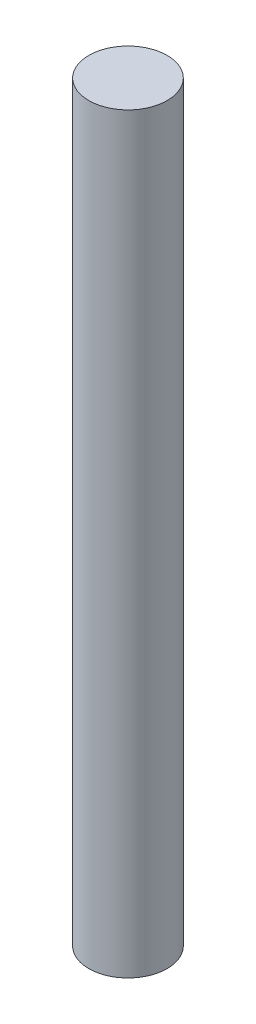
ISO-10303-21;
HEADER;
FILE_DESCRIPTION(('STEP AP214'),'2;1');
FILE_NAME('part.step','',(''),(''),'','','');
FILE_SCHEMA(('AUTOMOTIVE_DESIGN { 1 0 10303 214 1 1 1 1 }'));
ENDSEC;
DATA;
#1=APPLICATION_CONTEXT('core data for automotive mechanical design processes');
#2=APPLICATION_PROTOCOL_DEFINITION('international standard','automotive_design',2000,#1);
#3=PRODUCT_CONTEXT('',#1,'mechanical');
#4=PRODUCT('Part','Part','',(#3));
#5=PRODUCT_RELATED_PRODUCT_CATEGORY('part','',(#4));
#6=PRODUCT_DEFINITION_FORMATION('','',#4);
#7=PRODUCT_DEFINITION_CONTEXT('part definition',#1,'design');
#8=PRODUCT_DEFINITION('design','',#6,#7);
#9=PRODUCT_DEFINITION_SHAPE('','',#8);
#10=(LENGTH_UNIT() NAMED_UNIT(*) SI_UNIT(.MILLI.,.METRE.));
#11=(NAMED_UNIT(*) PLANE_ANGLE_UNIT() SI_UNIT($,.RADIAN.));
#12=(NAMED_UNIT(*) SI_UNIT($,.STERADIAN.) SOLID_ANGLE_UNIT());
#13=UNCERTAINTY_MEASURE_WITH_UNIT(LENGTH_MEASURE(1.E-05),#10,'distance_accuracy_value','');
#14=(GEOMETRIC_REPRESENTATION_CONTEXT(3) GLOBAL_UNCERTAINTY_ASSIGNED_CONTEXT((#13)) GLOBAL_UNIT_ASSIGNED_CONTEXT((#10,
#11,#12)) REPRESENTATION_CONTEXT('',''));
#15=CARTESIAN_POINT('',(0.,0.,0.));
#16=DIRECTION('',(0.,0.,1.));
#17=DIRECTION('',(1.,0.,0.));
#18=AXIS2_PLACEMENT_3D('',#15,#16,#17);
#19=CARTESIAN_POINT('',(0.,-1.6,0.));
#20=DIRECTION('',(0.,1.,0.));
#21=DIRECTION('',(0.,0.,1.));
#22=AXIS2_PLACEMENT_3D('',#19,#20,#21);
#23=CYLINDRICAL_SURFACE('',#22,0.5);
#24=CARTESIAN_POINT('',(0.,-1.6,0.));
#25=DIRECTION('',(0.,1.,0.));
#26=DIRECTION('',(0.,0.,1.));
#27=AXIS2_PLACEMENT_3D('',#24,#25,#26);
#28=CIRCLE('',#27,0.5);
#29=CARTESIAN_POINT('',(0.,-1.6,0.5));
#30=VERTEX_POINT('',#29);
#31=EDGE_CURVE('E10',#30,#30,#28,.T.);
#32=ORIENTED_EDGE('',*,*,#31,.T.);
#33=EDGE_LOOP('',(#32));
#34=FACE_BOUND('',#33,.T.);
#35=CARTESIAN_POINT('',(0.,8.,0.));
#36=DIRECTION('',(0.,1.,0.));
#37=DIRECTION('',(0.,0.,1.));
#38=AXIS2_PLACEMENT_3D('',#35,#36,#37);
#39=CIRCLE('',#38,0.5);
#40=CARTESIAN_POINT('',(0.,8.,0.5));
#41=VERTEX_POINT('',#40);
#42=EDGE_CURVE('E38',#41,#41,#39,.T.);
#43=ORIENTED_EDGE('',*,*,#42,.F.);
#44=EDGE_LOOP('',(#43));
#45=FACE_BOUND('',#44,.T.);
#46=ADVANCED_FACE('F32',(#34,#45),#23,.T.);
#47=CARTESIAN_POINT('',(0.,-1.6,0.));
#48=DIRECTION('',(0.,1.,0.));
#49=DIRECTION('',(0.,0.,1.));
#50=AXIS2_PLACEMENT_3D('',#47,#48,#49);
#51=PLANE('',#50);
#52=ORIENTED_EDGE('',*,*,#31,.F.);
#53=EDGE_LOOP('',(#52));
#54=FACE_BOUND('',#53,.T.);
#55=ADVANCED_FACE('F47',(#54),#51,.F.);
#56=CARTESIAN_POINT('',(0.,8.,0.));
#57=DIRECTION('',(0.,1.,0.));
#58=DIRECTION('',(0.,0.,1.));
#59=AXIS2_PLACEMENT_3D('',#56,#57,#58);
#60=PLANE('',#59);
#61=ORIENTED_EDGE('',*,*,#42,.T.);
#62=EDGE_LOOP('',(#61));
#63=FACE_BOUND('',#62,.T.);
#64=ADVANCED_FACE('F44',(#63),#60,.T.);
#65=CLOSED_SHELL('',(#46,#55,#64));
#66=MANIFOLD_SOLID_BREP('B2',#65);
#67=ADVANCED_BREP_SHAPE_REPRESENTATION('',(#18,#66),#14);
#68=SHAPE_DEFINITION_REPRESENTATION(#9,#67);
ENDSEC;
END-ISO-10303-21;
